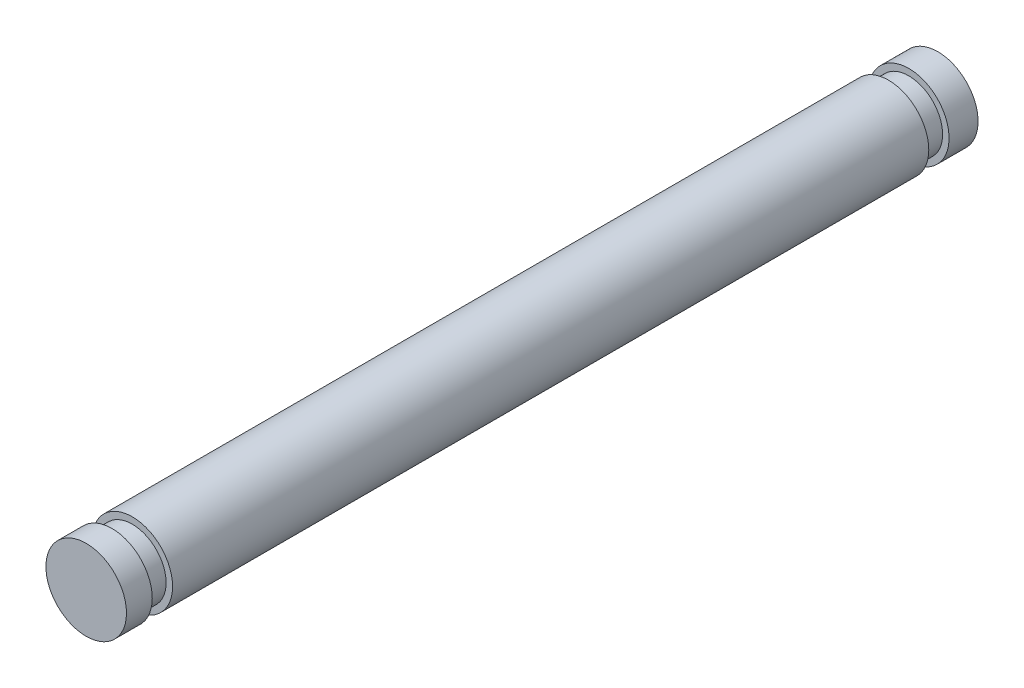
ISO-10303-21;
HEADER;
FILE_DESCRIPTION(('STEP AP214'),'2;1');
FILE_NAME('part.step','',(''),(''),'','','');
FILE_SCHEMA(('AUTOMOTIVE_DESIGN { 1 0 10303 214 1 1 1 1 }'));
ENDSEC;
DATA;
#1=APPLICATION_CONTEXT('core data for automotive mechanical design processes');
#2=APPLICATION_PROTOCOL_DEFINITION('international standard','automotive_design',2000,#1);
#3=PRODUCT_CONTEXT('',#1,'mechanical');
#4=PRODUCT('Part','Part','',(#3));
#5=PRODUCT_RELATED_PRODUCT_CATEGORY('part','',(#4));
#6=PRODUCT_DEFINITION_FORMATION('','',#4);
#7=PRODUCT_DEFINITION_CONTEXT('part definition',#1,'design');
#8=PRODUCT_DEFINITION('design','',#6,#7);
#9=PRODUCT_DEFINITION_SHAPE('','',#8);
#10=(LENGTH_UNIT() NAMED_UNIT(*) SI_UNIT(.MILLI.,.METRE.));
#11=(NAMED_UNIT(*) PLANE_ANGLE_UNIT() SI_UNIT($,.RADIAN.));
#12=(NAMED_UNIT(*) SI_UNIT($,.STERADIAN.) SOLID_ANGLE_UNIT());
#13=UNCERTAINTY_MEASURE_WITH_UNIT(LENGTH_MEASURE(1.E-05),#10,'distance_accuracy_value','');
#14=(GEOMETRIC_REPRESENTATION_CONTEXT(3) GLOBAL_UNCERTAINTY_ASSIGNED_CONTEXT((#13)) GLOBAL_UNIT_ASSIGNED_CONTEXT((#10,
#11,#12)) REPRESENTATION_CONTEXT('',''));
#15=CARTESIAN_POINT('',(0.,0.,0.));
#16=DIRECTION('',(0.,0.,1.));
#17=DIRECTION('',(1.,0.,0.));
#18=AXIS2_PLACEMENT_3D('',#15,#16,#17);
#19=CARTESIAN_POINT('',(0.,0.,59.6138));
#20=DIRECTION('',(0.,0.,-1.));
#21=DIRECTION('',(-1.,0.,0.));
#22=AXIS2_PLACEMENT_3D('',#19,#20,#21);
#23=CYLINDRICAL_SURFACE('',#22,3.175);
#24=CARTESIAN_POINT('',(0.,0.,59.6138));
#25=DIRECTION('',(0.,0.,1.));
#26=DIRECTION('',(1.,0.,0.));
#27=AXIS2_PLACEMENT_3D('',#24,#25,#26);
#28=CIRCLE('',#27,3.175);
#29=CARTESIAN_POINT('',(3.175,0.,59.6138));
#30=VERTEX_POINT('',#29);
#31=EDGE_CURVE('E42',#30,#30,#28,.T.);
#32=ORIENTED_EDGE('',*,*,#31,.F.);
#33=EDGE_LOOP('',(#32));
#34=FACE_BOUND('',#33,.T.);
#35=CARTESIAN_POINT('',(0.,0.,0.));
#36=DIRECTION('',(0.,0.,1.));
#37=DIRECTION('',(1.,0.,0.));
#38=AXIS2_PLACEMENT_3D('',#35,#36,#37);
#39=CIRCLE('',#38,3.175);
#40=CARTESIAN_POINT('',(3.175,0.,0.));
#41=VERTEX_POINT('',#40);
#42=EDGE_CURVE('E33',#41,#41,#39,.T.);
#43=ORIENTED_EDGE('',*,*,#42,.T.);
#44=EDGE_LOOP('',(#43));
#45=FACE_BOUND('',#44,.T.);
#46=ADVANCED_FACE('F30',(#34,#45),#23,.T.);
#47=CARTESIAN_POINT('',(0.,0.,59.6138));
#48=DIRECTION('',(0.,0.,1.));
#49=DIRECTION('',(1.,0.,0.));
#50=AXIS2_PLACEMENT_3D('',#47,#48,#49);
#51=PLANE('',#50);
#52=CARTESIAN_POINT('',(0.,0.,59.6138));
#53=DIRECTION('',(0.,0.,1.));
#54=DIRECTION('',(1.,0.,0.));
#55=AXIS2_PLACEMENT_3D('',#52,#53,#54);
#56=CIRCLE('',#55,2.667);
#57=CARTESIAN_POINT('',(2.667,0.,59.6138));
#58=VERTEX_POINT('',#57);
#59=EDGE_CURVE('E10',#58,#58,#56,.T.);
#60=ORIENTED_EDGE('',*,*,#59,.F.);
#61=EDGE_LOOP('',(#60));
#62=FACE_BOUND('',#61,.T.);
#63=ORIENTED_EDGE('',*,*,#31,.T.);
#64=EDGE_LOOP('',(#63));
#65=FACE_BOUND('',#64,.T.);
#66=ADVANCED_FACE('F66',(#62,#65),#51,.T.);
#67=CARTESIAN_POINT('',(0.,0.,0.));
#68=DIRECTION('',(0.,0.,1.));
#69=DIRECTION('',(1.,0.,0.));
#70=AXIS2_PLACEMENT_3D('',#67,#68,#69);
#71=PLANE('',#70);
#72=CARTESIAN_POINT('',(0.,0.,0.));
#73=DIRECTION('',(0.,0.,-1.));
#74=DIRECTION('',(-1.,0.,0.));
#75=AXIS2_PLACEMENT_3D('',#72,#73,#74);
#76=CIRCLE('',#75,2.667);
#77=CARTESIAN_POINT('',(-2.667,0.,0.));
#78=VERTEX_POINT('',#77);
#79=EDGE_CURVE('E37',#78,#78,#76,.T.);
#80=ORIENTED_EDGE('',*,*,#79,.F.);
#81=EDGE_LOOP('',(#80));
#82=FACE_BOUND('',#81,.T.);
#83=ORIENTED_EDGE('',*,*,#42,.F.);
#84=EDGE_LOOP('',(#83));
#85=FACE_BOUND('',#84,.T.);
#86=ADVANCED_FACE('F63',(#82,#85),#71,.F.);
#87=CARTESIAN_POINT('',(0.,0.,-1.6002));
#88=DIRECTION('',(0.,0.,1.));
#89=DIRECTION('',(1.,0.,0.));
#90=AXIS2_PLACEMENT_3D('',#87,#88,#89);
#91=CYLINDRICAL_SURFACE('',#90,2.667);
#92=CARTESIAN_POINT('',(0.,0.,-1.6002));
#93=DIRECTION('',(0.,0.,-1.));
#94=DIRECTION('',(-1.,0.,0.));
#95=AXIS2_PLACEMENT_3D('',#92,#93,#94);
#96=CIRCLE('',#95,2.667);
#97=CARTESIAN_POINT('',(-2.667,0.,-1.6002));
#98=VERTEX_POINT('',#97);
#99=EDGE_CURVE('E51',#98,#98,#96,.T.);
#100=ORIENTED_EDGE('',*,*,#99,.F.);
#101=EDGE_LOOP('',(#100));
#102=FACE_BOUND('',#101,.T.);
#103=ORIENTED_EDGE('',*,*,#79,.T.);
#104=EDGE_LOOP('',(#103));
#105=FACE_BOUND('',#104,.T.);
#106=ADVANCED_FACE('F65',(#102,#105),#91,.T.);
#107=CARTESIAN_POINT('',(0.,0.,-3.8862));
#108=DIRECTION('',(0.,0.,1.));
#109=DIRECTION('',(1.,0.,0.));
#110=AXIS2_PLACEMENT_3D('',#107,#108,#109);
#111=CYLINDRICAL_SURFACE('',#110,3.175);
#112=CARTESIAN_POINT('',(0.,0.,-3.8862));
#113=DIRECTION('',(0.,0.,-1.));
#114=DIRECTION('',(-1.,0.,0.));
#115=AXIS2_PLACEMENT_3D('',#112,#113,#114);
#116=CIRCLE('',#115,3.175);
#117=CARTESIAN_POINT('',(-3.175,0.,-3.8862));
#118=VERTEX_POINT('',#117);
#119=EDGE_CURVE('E48',#118,#118,#116,.T.);
#120=ORIENTED_EDGE('',*,*,#119,.F.);
#121=EDGE_LOOP('',(#120));
#122=FACE_BOUND('',#121,.T.);
#123=CARTESIAN_POINT('',(0.,0.,-1.6002));
#124=DIRECTION('',(0.,0.,-1.));
#125=DIRECTION('',(-1.,0.,0.));
#126=AXIS2_PLACEMENT_3D('',#123,#124,#125);
#127=CIRCLE('',#126,3.175);
#128=CARTESIAN_POINT('',(-3.175,0.,-1.6002));
#129=VERTEX_POINT('',#128);
#130=EDGE_CURVE('E52',#129,#129,#127,.T.);
#131=ORIENTED_EDGE('',*,*,#130,.T.);
#132=EDGE_LOOP('',(#131));
#133=FACE_BOUND('',#132,.T.);
#134=ADVANCED_FACE('F72',(#122,#133),#111,.T.);
#135=CARTESIAN_POINT('',(0.,0.,-3.8862));
#136=DIRECTION('',(0.,0.,-1.));
#137=DIRECTION('',(-1.,0.,0.));
#138=AXIS2_PLACEMENT_3D('',#135,#136,#137);
#139=PLANE('',#138);
#140=ORIENTED_EDGE('',*,*,#119,.T.);
#141=EDGE_LOOP('',(#140));
#142=FACE_BOUND('',#141,.T.);
#143=ADVANCED_FACE('F140',(#142),#139,.T.);
#144=CARTESIAN_POINT('',(0.,0.,-1.6002));
#145=DIRECTION('',(0.,0.,-1.));
#146=DIRECTION('',(-1.,0.,0.));
#147=AXIS2_PLACEMENT_3D('',#144,#145,#146);
#148=PLANE('',#147);
#149=ORIENTED_EDGE('',*,*,#99,.T.);
#150=EDGE_LOOP('',(#149));
#151=FACE_BOUND('',#150,.T.);
#152=ORIENTED_EDGE('',*,*,#130,.F.);
#153=EDGE_LOOP('',(#152));
#154=FACE_BOUND('',#153,.T.);
#155=ADVANCED_FACE('F93',(#151,#154),#148,.F.);
#156=CARTESIAN_POINT('',(0.,0.,61.214));
#157=DIRECTION('',(0.,0.,-1.));
#158=DIRECTION('',(-1.,0.,0.));
#159=AXIS2_PLACEMENT_3D('',#156,#157,#158);
#160=CYLINDRICAL_SURFACE('',#159,2.667);
#161=CARTESIAN_POINT('',(0.,0.,61.214));
#162=DIRECTION('',(0.,0.,1.));
#163=DIRECTION('',(1.,0.,0.));
#164=AXIS2_PLACEMENT_3D('',#161,#162,#163);
#165=CIRCLE('',#164,2.667);
#166=CARTESIAN_POINT('',(2.667,0.,61.214));
#167=VERTEX_POINT('',#166);
#168=EDGE_CURVE('E46',#167,#167,#165,.T.);
#169=ORIENTED_EDGE('',*,*,#168,.F.);
#170=EDGE_LOOP('',(#169));
#171=FACE_BOUND('',#170,.T.);
#172=ORIENTED_EDGE('',*,*,#59,.T.);
#173=EDGE_LOOP('',(#172));
#174=FACE_BOUND('',#173,.T.);
#175=ADVANCED_FACE('F98',(#171,#174),#160,.T.);
#176=CARTESIAN_POINT('',(0.,0.,63.246));
#177=DIRECTION('',(0.,0.,-1.));
#178=DIRECTION('',(-1.,0.,0.));
#179=AXIS2_PLACEMENT_3D('',#176,#177,#178);
#180=CYLINDRICAL_SURFACE('',#179,3.175);
#181=CARTESIAN_POINT('',(0.,0.,63.246));
#182=DIRECTION('',(0.,0.,1.));
#183=DIRECTION('',(1.,0.,0.));
#184=AXIS2_PLACEMENT_3D('',#181,#182,#183);
#185=CIRCLE('',#184,3.175);
#186=CARTESIAN_POINT('',(3.175,0.,63.246));
#187=VERTEX_POINT('',#186);
#188=EDGE_CURVE('E182',#187,#187,#185,.T.);
#189=ORIENTED_EDGE('',*,*,#188,.F.);
#190=EDGE_LOOP('',(#189));
#191=FACE_BOUND('',#190,.T.);
#192=CARTESIAN_POINT('',(0.,0.,61.214));
#193=DIRECTION('',(0.,0.,1.));
#194=DIRECTION('',(1.,0.,0.));
#195=AXIS2_PLACEMENT_3D('',#192,#193,#194);
#196=CIRCLE('',#195,3.175);
#197=CARTESIAN_POINT('',(3.175,0.,61.214));
#198=VERTEX_POINT('',#197);
#199=EDGE_CURVE('E180',#198,#198,#196,.T.);
#200=ORIENTED_EDGE('',*,*,#199,.T.);
#201=EDGE_LOOP('',(#200));
#202=FACE_BOUND('',#201,.T.);
#203=ADVANCED_FACE('F103',(#191,#202),#180,.T.);
#204=CARTESIAN_POINT('',(0.,0.,63.246));
#205=DIRECTION('',(0.,0.,1.));
#206=DIRECTION('',(1.,0.,0.));
#207=AXIS2_PLACEMENT_3D('',#204,#205,#206);
#208=PLANE('',#207);
#209=ORIENTED_EDGE('',*,*,#188,.T.);
#210=EDGE_LOOP('',(#209));
#211=FACE_BOUND('',#210,.T.);
#212=ADVANCED_FACE('F113',(#211),#208,.T.);
#213=CARTESIAN_POINT('',(0.,0.,61.214));
#214=DIRECTION('',(0.,0.,1.));
#215=DIRECTION('',(1.,0.,0.));
#216=AXIS2_PLACEMENT_3D('',#213,#214,#215);
#217=PLANE('',#216);
#218=ORIENTED_EDGE('',*,*,#168,.T.);
#219=EDGE_LOOP('',(#218));
#220=FACE_BOUND('',#219,.T.);
#221=ORIENTED_EDGE('',*,*,#199,.F.);
#222=EDGE_LOOP('',(#221));
#223=FACE_BOUND('',#222,.T.);
#224=ADVANCED_FACE('F123',(#220,#223),#217,.F.);
#225=CLOSED_SHELL('',(#46,#66,#86,#106,#134,#143,#155,#175,#203,#212,#224));
#226=MANIFOLD_SOLID_BREP('B2',#225);
#227=ADVANCED_BREP_SHAPE_REPRESENTATION('',(#18,#226),#14);
#228=SHAPE_DEFINITION_REPRESENTATION(#9,#227);
ENDSEC;
END-ISO-10303-21;
